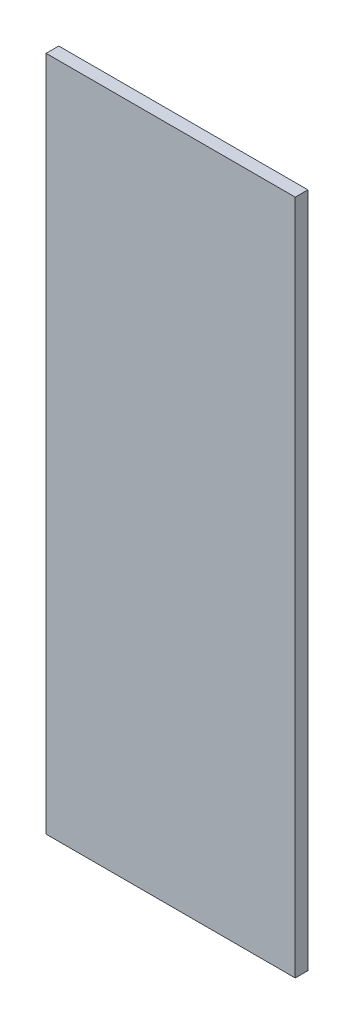
ISO-10303-21;
HEADER;
FILE_DESCRIPTION(('STEP AP214'),'2;1');
FILE_NAME('part.step','',(''),(''),'','','');
FILE_SCHEMA(('AUTOMOTIVE_DESIGN { 1 0 10303 214 1 1 1 1 }'));
ENDSEC;
DATA;
#1=APPLICATION_CONTEXT('core data for automotive mechanical design processes');
#2=APPLICATION_PROTOCOL_DEFINITION('international standard','automotive_design',2000,#1);
#3=PRODUCT_CONTEXT('',#1,'mechanical');
#4=PRODUCT('Part','Part','',(#3));
#5=PRODUCT_RELATED_PRODUCT_CATEGORY('part','',(#4));
#6=PRODUCT_DEFINITION_FORMATION('','',#4);
#7=PRODUCT_DEFINITION_CONTEXT('part definition',#1,'design');
#8=PRODUCT_DEFINITION('design','',#6,#7);
#9=PRODUCT_DEFINITION_SHAPE('','',#8);
#10=(LENGTH_UNIT() NAMED_UNIT(*) SI_UNIT(.MILLI.,.METRE.));
#11=(NAMED_UNIT(*) PLANE_ANGLE_UNIT() SI_UNIT($,.RADIAN.));
#12=(NAMED_UNIT(*) SI_UNIT($,.STERADIAN.) SOLID_ANGLE_UNIT());
#13=UNCERTAINTY_MEASURE_WITH_UNIT(LENGTH_MEASURE(1.E-05),#10,'distance_accuracy_value','');
#14=(GEOMETRIC_REPRESENTATION_CONTEXT(3) GLOBAL_UNCERTAINTY_ASSIGNED_CONTEXT((#13)) GLOBAL_UNIT_ASSIGNED_CONTEXT((#10,
#11,#12)) REPRESENTATION_CONTEXT('',''));
#15=CARTESIAN_POINT('',(0.,0.,0.));
#16=DIRECTION('',(0.,0.,1.));
#17=DIRECTION('',(1.,0.,0.));
#18=AXIS2_PLACEMENT_3D('',#15,#16,#17);
#19=CARTESIAN_POINT('',(90.4420013427734,53.8279991149902,0.));
#20=DIRECTION('',(1.,0.,0.));
#21=DIRECTION('',(0.,-1.,0.));
#22=AXIS2_PLACEMENT_3D('',#19,#20,#21);
#23=PLANE('',#22);
#24=DIRECTION('',(0.,-1.,0.));
#25=VECTOR('',#24,1.);
#26=CARTESIAN_POINT('',(90.4420013427734,53.8279991149902,0.03556));
#27=LINE('',#26,#25);
#28=CARTESIAN_POINT('',(90.4420013427734,53.8279991149902,0.03556));
#29=VERTEX_POINT('',#28);
#30=CARTESIAN_POINT('',(90.4420013427734,51.9280014038086,0.03556));
#31=VERTEX_POINT('',#30);
#32=EDGE_CURVE('E11',#29,#31,#27,.T.);
#33=ORIENTED_EDGE('',*,*,#32,.F.);
#34=DIRECTION('',(0.,0.,1.));
#35=VECTOR('',#34,1.);
#36=CARTESIAN_POINT('',(90.4420013427734,53.8279991149902,0.));
#37=LINE('',#36,#35);
#38=CARTESIAN_POINT('',(90.4420013427734,53.8279991149902,0.));
#39=VERTEX_POINT('',#38);
#40=EDGE_CURVE('E24',#39,#29,#37,.T.);
#41=ORIENTED_EDGE('',*,*,#40,.F.);
#42=DIRECTION('',(0.,-1.,0.));
#43=VECTOR('',#42,1.);
#44=CARTESIAN_POINT('',(90.4420013427734,53.8279991149902,0.));
#45=LINE('',#44,#43);
#46=CARTESIAN_POINT('',(90.4420013427734,51.9280014038086,0.));
#47=VERTEX_POINT('',#46);
#48=EDGE_CURVE('E75',#39,#47,#45,.T.);
#49=ORIENTED_EDGE('',*,*,#48,.T.);
#50=DIRECTION('',(0.,0.,1.));
#51=VECTOR('',#50,1.);
#52=CARTESIAN_POINT('',(90.4420013427734,51.9280014038086,0.));
#53=LINE('',#52,#51);
#54=EDGE_CURVE('E37',#47,#31,#53,.T.);
#55=ORIENTED_EDGE('',*,*,#54,.T.);
#56=EDGE_LOOP('',(#33,#41,#49,#55));
#57=FACE_BOUND('',#56,.T.);
#58=ADVANCED_FACE('F17',(#57),#23,.F.);
#59=CARTESIAN_POINT('',(90.4420013427734,51.9280014038086,0.));
#60=DIRECTION('',(0.,1.,0.));
#61=DIRECTION('',(1.,0.,0.));
#62=AXIS2_PLACEMENT_3D('',#59,#60,#61);
#63=PLANE('',#62);
#64=DIRECTION('',(1.,0.,0.));
#65=VECTOR('',#64,1.);
#66=CARTESIAN_POINT('',(90.4420013427734,51.9280014038086,0.03556));
#67=LINE('',#66,#65);
#68=CARTESIAN_POINT('',(91.1419982910156,51.9280014038086,0.03556));
#69=VERTEX_POINT('',#68);
#70=EDGE_CURVE('E83',#31,#69,#67,.T.);
#71=ORIENTED_EDGE('',*,*,#70,.F.);
#72=ORIENTED_EDGE('',*,*,#54,.F.);
#73=DIRECTION('',(1.,0.,0.));
#74=VECTOR('',#73,1.);
#75=CARTESIAN_POINT('',(90.4420013427734,51.9280014038086,0.));
#76=LINE('',#75,#74);
#77=CARTESIAN_POINT('',(91.1419982910156,51.9280014038086,0.));
#78=VERTEX_POINT('',#77);
#79=EDGE_CURVE('E81',#47,#78,#76,.T.);
#80=ORIENTED_EDGE('',*,*,#79,.T.);
#81=DIRECTION('',(0.,0.,1.));
#82=VECTOR('',#81,1.);
#83=CARTESIAN_POINT('',(91.1419982910156,51.9280014038086,0.));
#84=LINE('',#83,#82);
#85=EDGE_CURVE('E67',#78,#69,#84,.T.);
#86=ORIENTED_EDGE('',*,*,#85,.T.);
#87=EDGE_LOOP('',(#71,#72,#80,#86));
#88=FACE_BOUND('',#87,.T.);
#89=ADVANCED_FACE('F89',(#88),#63,.F.);
#90=CARTESIAN_POINT('',(91.1419982910156,51.9280014038086,0.));
#91=DIRECTION('',(-1.,0.,0.));
#92=DIRECTION('',(0.,1.,0.));
#93=AXIS2_PLACEMENT_3D('',#90,#91,#92);
#94=PLANE('',#93);
#95=DIRECTION('',(0.,1.,0.));
#96=VECTOR('',#95,1.);
#97=CARTESIAN_POINT('',(91.1419982910156,51.9280014038086,0.03556));
#98=LINE('',#97,#96);
#99=CARTESIAN_POINT('',(91.1419982910156,53.8279991149902,0.03556));
#100=VERTEX_POINT('',#99);
#101=EDGE_CURVE('E71',#69,#100,#98,.T.);
#102=ORIENTED_EDGE('',*,*,#101,.F.);
#103=ORIENTED_EDGE('',*,*,#85,.F.);
#104=DIRECTION('',(0.,1.,0.));
#105=VECTOR('',#104,1.);
#106=CARTESIAN_POINT('',(91.1419982910156,51.9280014038086,0.));
#107=LINE('',#106,#105);
#108=CARTESIAN_POINT('',(91.1419982910156,53.8279991149902,0.));
#109=VERTEX_POINT('',#108);
#110=EDGE_CURVE('E63',#78,#109,#107,.T.);
#111=ORIENTED_EDGE('',*,*,#110,.T.);
#112=DIRECTION('',(0.,0.,1.));
#113=VECTOR('',#112,1.);
#114=CARTESIAN_POINT('',(91.1419982910156,53.8279991149902,0.));
#115=LINE('',#114,#113);
#116=EDGE_CURVE('E53',#109,#100,#115,.T.);
#117=ORIENTED_EDGE('',*,*,#116,.T.);
#118=EDGE_LOOP('',(#102,#103,#111,#117));
#119=FACE_BOUND('',#118,.T.);
#120=ADVANCED_FACE('F66',(#119),#94,.F.);
#121=CARTESIAN_POINT('',(91.1419982910156,53.8279991149902,0.));
#122=DIRECTION('',(0.,-1.,0.));
#123=DIRECTION('',(-1.,0.,0.));
#124=AXIS2_PLACEMENT_3D('',#121,#122,#123);
#125=PLANE('',#124);
#126=DIRECTION('',(-1.,0.,0.));
#127=VECTOR('',#126,1.);
#128=CARTESIAN_POINT('',(91.1419982910156,53.8279991149902,0.03556));
#129=LINE('',#128,#127);
#130=EDGE_CURVE('E59',#100,#29,#129,.T.);
#131=ORIENTED_EDGE('',*,*,#130,.F.);
#132=ORIENTED_EDGE('',*,*,#116,.F.);
#133=DIRECTION('',(-1.,0.,0.));
#134=VECTOR('',#133,1.);
#135=CARTESIAN_POINT('',(91.1419982910156,53.8279991149902,0.));
#136=LINE('',#135,#134);
#137=EDGE_CURVE('E57',#109,#39,#136,.T.);
#138=ORIENTED_EDGE('',*,*,#137,.T.);
#139=ORIENTED_EDGE('',*,*,#40,.T.);
#140=EDGE_LOOP('',(#131,#132,#138,#139));
#141=FACE_BOUND('',#140,.T.);
#142=ADVANCED_FACE('F55',(#141),#125,.F.);
#143=CARTESIAN_POINT('',(90.4420013427734,53.8279991149902,0.));
#144=DIRECTION('',(0.,0.,-1.));
#145=DIRECTION('',(-1.,0.,0.));
#146=AXIS2_PLACEMENT_3D('',#143,#144,#145);
#147=PLANE('',#146);
#148=ORIENTED_EDGE('',*,*,#137,.F.);
#149=ORIENTED_EDGE('',*,*,#110,.F.);
#150=ORIENTED_EDGE('',*,*,#79,.F.);
#151=ORIENTED_EDGE('',*,*,#48,.F.);
#152=EDGE_LOOP('',(#148,#149,#150,#151));
#153=FACE_BOUND('',#152,.T.);
#154=ADVANCED_FACE('F74',(#153),#147,.T.);
#155=CARTESIAN_POINT('',(90.4420013427734,53.8279991149902,0.03556));
#156=DIRECTION('',(0.,0.,-1.));
#157=DIRECTION('',(-1.,0.,0.));
#158=AXIS2_PLACEMENT_3D('',#155,#156,#157);
#159=PLANE('',#158);
#160=ORIENTED_EDGE('',*,*,#32,.T.);
#161=ORIENTED_EDGE('',*,*,#70,.T.);
#162=ORIENTED_EDGE('',*,*,#101,.T.);
#163=ORIENTED_EDGE('',*,*,#130,.T.);
#164=EDGE_LOOP('',(#160,#161,#162,#163));
#165=FACE_BOUND('',#164,.T.);
#166=ADVANCED_FACE('F91',(#165),#159,.F.);
#167=CLOSED_SHELL('',(#58,#89,#120,#142,#154,#166));
#168=MANIFOLD_SOLID_BREP('B1',#167);
#169=ADVANCED_BREP_SHAPE_REPRESENTATION('',(#18,#168),#14);
#170=SHAPE_DEFINITION_REPRESENTATION(#9,#169);
ENDSEC;
END-ISO-10303-21;
